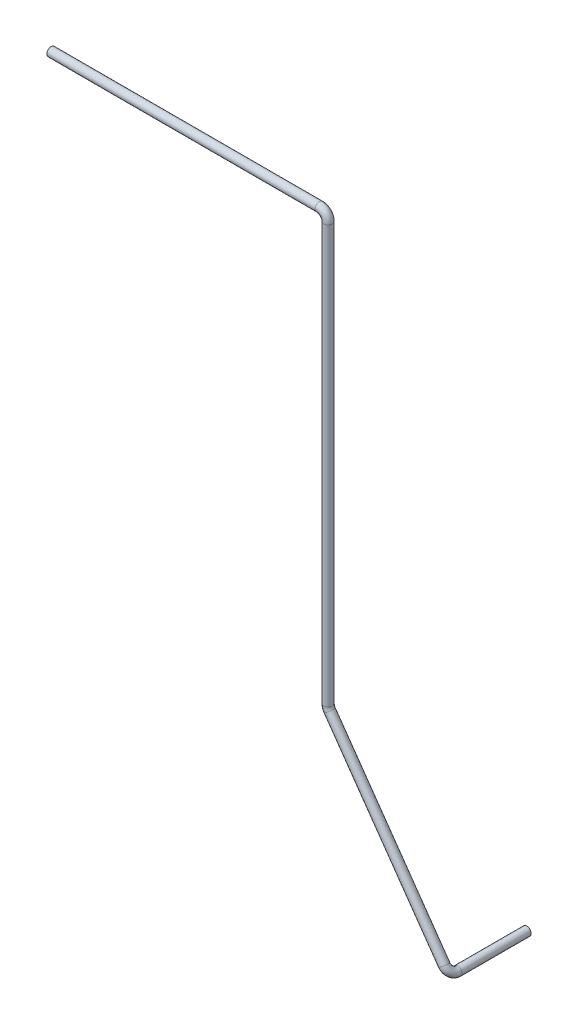
ISO-10303-21;
HEADER;
FILE_DESCRIPTION(('STEP AP214'),'2;1');
FILE_NAME('part.step','',(''),(''),'','','');
FILE_SCHEMA(('AUTOMOTIVE_DESIGN { 1 0 10303 214 1 1 1 1 }'));
ENDSEC;
DATA;
#1=APPLICATION_CONTEXT('core data for automotive mechanical design processes');
#2=APPLICATION_PROTOCOL_DEFINITION('international standard','automotive_design',2000,#1);
#3=PRODUCT_CONTEXT('',#1,'mechanical');
#4=PRODUCT('Part','Part','',(#3));
#5=PRODUCT_RELATED_PRODUCT_CATEGORY('part','',(#4));
#6=PRODUCT_DEFINITION_FORMATION('','',#4);
#7=PRODUCT_DEFINITION_CONTEXT('part definition',#1,'design');
#8=PRODUCT_DEFINITION('design','',#6,#7);
#9=PRODUCT_DEFINITION_SHAPE('','',#8);
#10=(LENGTH_UNIT() NAMED_UNIT(*) SI_UNIT(.MILLI.,.METRE.));
#11=(NAMED_UNIT(*) PLANE_ANGLE_UNIT() SI_UNIT($,.RADIAN.));
#12=(NAMED_UNIT(*) SI_UNIT($,.STERADIAN.) SOLID_ANGLE_UNIT());
#13=UNCERTAINTY_MEASURE_WITH_UNIT(LENGTH_MEASURE(1.E-05),#10,'distance_accuracy_value','');
#14=(GEOMETRIC_REPRESENTATION_CONTEXT(3) GLOBAL_UNCERTAINTY_ASSIGNED_CONTEXT((#13)) GLOBAL_UNIT_ASSIGNED_CONTEXT((#10,
#11,#12)) REPRESENTATION_CONTEXT('',''));
#15=CARTESIAN_POINT('',(0.,0.,0.));
#16=DIRECTION('',(0.,0.,1.));
#17=DIRECTION('',(1.,0.,0.));
#18=AXIS2_PLACEMENT_3D('',#15,#16,#17);
#19=CARTESIAN_POINT('',(-31243.2781005083,-14167.0136339347,40791.8371076484));
#20=DIRECTION('',(-1.,0.,0.));
#21=DIRECTION('',(0.,0.818643838091512,0.574301546537007));
#22=AXIS2_PLACEMENT_3D('',#19,#20,#21);
#23=PLANE('',#22);
#24=CARTESIAN_POINT('',(-31243.2781005083,-14167.0136339347,40791.8371076484));
#25=DIRECTION('',(-1.,0.,0.));
#26=DIRECTION('',(0.,0.,1.));
#27=AXIS2_PLACEMENT_3D('',#24,#25,#26);
#28=CIRCLE('',#27,14.0000000000006);
#29=CARTESIAN_POINT('',(-31243.2781005083,-14167.0136339347,40805.8371076484));
#30=VERTEX_POINT('',#29);
#31=EDGE_CURVE('E82',#30,#30,#28,.T.);
#32=ORIENTED_EDGE('',*,*,#31,.F.);
#33=EDGE_LOOP('',(#32));
#34=FACE_BOUND('',#33,.T.);
#35=CARTESIAN_POINT('',(-31243.2781005083,-14167.0136339347,40791.8371076484));
#36=DIRECTION('',(-1.,0.,0.));
#37=DIRECTION('',(0.,0.818643838091512,0.574301546537007));
#38=AXIS2_PLACEMENT_3D('',#35,#36,#37);
#39=CIRCLE('',#38,15.0000000000006);
#40=CARTESIAN_POINT('',(-31243.2781005083,-14154.7339763633,40800.4516308465));
#41=VERTEX_POINT('',#40);
#42=EDGE_CURVE('E75',#41,#41,#39,.T.);
#43=ORIENTED_EDGE('',*,*,#42,.T.);
#44=EDGE_LOOP('',(#43));
#45=FACE_BOUND('',#44,.T.);
#46=ADVANCED_FACE('F47',(#34,#45),#23,.T.);
#47=CARTESIAN_POINT('',(-29859.7978557255,-16257.8595632953,40521.7031960563));
#48=DIRECTION('',(0.,0.,1.));
#49=DIRECTION('',(1.,0.,0.));
#50=AXIS2_PLACEMENT_3D('',#47,#48,#49);
#51=PLANE('',#50);
#52=CARTESIAN_POINT('',(-29859.7978557255,-16257.8595632953,40521.7031960563));
#53=DIRECTION('',(0.,0.,1.));
#54=DIRECTION('',(1.,0.,0.));
#55=AXIS2_PLACEMENT_3D('',#52,#53,#54);
#56=CIRCLE('',#55,14.0000000000006);
#57=CARTESIAN_POINT('',(-29845.7978557255,-16257.8595632953,40521.7031960563));
#58=VERTEX_POINT('',#57);
#59=EDGE_CURVE('E78',#58,#58,#56,.T.);
#60=ORIENTED_EDGE('',*,*,#59,.T.);
#61=EDGE_LOOP('',(#60));
#62=FACE_BOUND('',#61,.T.);
#63=CARTESIAN_POINT('',(-29859.7978557255,-16257.8595632953,40521.7031960563));
#64=DIRECTION('',(0.,0.,1.));
#65=DIRECTION('',(1.,0.,0.));
#66=AXIS2_PLACEMENT_3D('',#63,#64,#65);
#67=CIRCLE('',#66,15.0000000000006);
#68=CARTESIAN_POINT('',(-29844.7978557255,-16257.8595632953,40521.7031960563));
#69=VERTEX_POINT('',#68);
#70=EDGE_CURVE('E11',#69,#69,#67,.T.);
#71=ORIENTED_EDGE('',*,*,#70,.F.);
#72=EDGE_LOOP('',(#71));
#73=FACE_BOUND('',#72,.T.);
#74=ADVANCED_FACE('F114',(#62,#73),#51,.F.);
#75=CARTESIAN_POINT('',(-31243.2781005083,-14167.0136339347,40791.8371076484));
#76=DIRECTION('',(1.,0.,0.));
#77=DIRECTION('',(0.,0.,-1.));
#78=AXIS2_PLACEMENT_3D('',#75,#76,#77);
#79=CYLINDRICAL_SURFACE('',#78,15.0000000000006);
#80=CARTESIAN_POINT('',(-30310.4639661704,-14167.0136339347,40791.8371076484));
#81=DIRECTION('',(-1.,0.,0.));
#82=DIRECTION('',(0.,0.818643838091512,0.574301546537007));
#83=AXIS2_PLACEMENT_3D('',#80,#81,#82);
#84=CIRCLE('',#83,15.0000000000006);
#85=CARTESIAN_POINT('',(-30310.4639661704,-14152.0136339347,40791.8371076484));
#86=VERTEX_POINT('',#85);
#87=EDGE_CURVE('E72',#86,#86,#84,.T.);
#88=ORIENTED_EDGE('',*,*,#87,.T.);
#89=EDGE_LOOP('',(#88));
#90=FACE_BOUND('',#89,.T.);
#91=ORIENTED_EDGE('',*,*,#42,.F.);
#92=EDGE_LOOP('',(#91));
#93=FACE_BOUND('',#92,.T.);
#94=ADVANCED_FACE('F118',(#90,#93),#79,.T.);
#95=CARTESIAN_POINT('',(-30310.4639661704,-14197.0136339347,40791.8371076484));
#96=DIRECTION('',(0.,0.,-1.));
#97=DIRECTION('',(-1.,0.,0.));
#98=AXIS2_PLACEMENT_3D('',#95,#96,#97);
#99=TOROIDAL_SURFACE('',#98,30.0000000000011,15.0000000000006);
#100=CARTESIAN_POINT('',(-30280.4639661704,-14197.0136339347,40791.8371076484));
#101=DIRECTION('',(0.,1.,0.));
#102=DIRECTION('',(0.818643838091512,0.,0.574301546537007));
#103=AXIS2_PLACEMENT_3D('',#100,#101,#102);
#104=CIRCLE('',#103,15.0000000000006);
#105=CARTESIAN_POINT('',(-30265.4639661704,-14197.0136339347,40791.8371076484));
#106=VERTEX_POINT('',#105);
#107=EDGE_CURVE('E69',#106,#106,#104,.T.);
#108=CARTESIAN_POINT('',(-30310.4639661704,-14197.0136339347,40791.8371076484));
#109=DIRECTION('',(0.,0.,-1.));
#110=DIRECTION('',(-1.,0.,0.));
#111=AXIS2_PLACEMENT_3D('',#108,#109,#110);
#112=CIRCLE('',#111,45.0000000000017);
#113=EDGE_CURVE('',#86,#106,#112,.T.);
#114=ORIENTED_EDGE('',*,*,#87,.F.);
#115=ORIENTED_EDGE('',*,*,#107,.T.);
#116=ORIENTED_EDGE('',*,*,#113,.T.);
#117=ORIENTED_EDGE('',*,*,#113,.F.);
#118=EDGE_LOOP('',(#114,#116,#115,#117));
#119=FACE_BOUND('',#118,.T.);
#120=ADVANCED_FACE('F120',(#119),#99,.T.);
#121=CARTESIAN_POINT('',(-30280.4639661704,-14197.0136339347,40791.8371076484));
#122=DIRECTION('',(0.,-1.,0.));
#123=DIRECTION('',(0.,0.,-1.));
#124=AXIS2_PLACEMENT_3D('',#121,#122,#123);
#125=CYLINDRICAL_SURFACE('',#124,15.0000000000006);
#126=CARTESIAN_POINT('',(-30280.4639661704,-15648.7433138681,40791.8371076484));
#127=DIRECTION('',(0.,1.,0.));
#128=DIRECTION('',(0.818643838091512,0.,0.574301546537007));
#129=AXIS2_PLACEMENT_3D('',#126,#127,#128);
#130=CIRCLE('',#129,15.0000000000006);
#131=CARTESIAN_POINT('',(-30295.4639661704,-15648.7433138681,40791.8371076484));
#132=VERTEX_POINT('',#131);
#133=EDGE_CURVE('E66',#132,#132,#130,.T.);
#134=ORIENTED_EDGE('',*,*,#133,.T.);
#135=EDGE_LOOP('',(#134));
#136=FACE_BOUND('',#135,.T.);
#137=ORIENTED_EDGE('',*,*,#107,.F.);
#138=EDGE_LOOP('',(#137));
#139=FACE_BOUND('',#138,.T.);
#140=ADVANCED_FACE('F127',(#136,#139),#125,.T.);
#141=CARTESIAN_POINT('',(-30250.4639661704,-15648.7433138681,40791.8371076484));
#142=DIRECTION('',(0.,0.,1.));
#143=DIRECTION('',(1.,0.,0.));
#144=AXIS2_PLACEMENT_3D('',#141,#142,#143);
#145=TOROIDAL_SURFACE('',#144,30.0000000000011,15.0000000000006);
#146=CARTESIAN_POINT('',(-30275.0232813132,-15665.9723602642,40791.8371076484));
#147=DIRECTION('',(-0.574301546536833,0.818643838091634,0.));
#148=DIRECTION('',(0.670177733645302,0.470148422278804,0.574301546537007));
#149=AXIS2_PLACEMENT_3D('',#146,#147,#148);
#150=CIRCLE('',#149,15.0000000000006);
#151=CARTESIAN_POINT('',(-30287.3029388845,-15674.5868834622,40791.8371076484));
#152=VERTEX_POINT('',#151);
#153=EDGE_CURVE('E61',#152,#152,#150,.T.);
#154=CARTESIAN_POINT('',(-30250.4639661704,-15648.7433138681,40791.8371076484));
#155=DIRECTION('',(0.,0.,1.));
#156=DIRECTION('',(1.,0.,0.));
#157=AXIS2_PLACEMENT_3D('',#154,#155,#156);
#158=CIRCLE('',#157,45.0000000000017);
#159=EDGE_CURVE('',#132,#152,#158,.T.);
#160=ORIENTED_EDGE('',*,*,#133,.F.);
#161=ORIENTED_EDGE('',*,*,#153,.T.);
#162=ORIENTED_EDGE('',*,*,#159,.T.);
#163=ORIENTED_EDGE('',*,*,#159,.F.);
#164=EDGE_LOOP('',(#160,#162,#161,#163));
#165=FACE_BOUND('',#164,.T.);
#166=ADVANCED_FACE('F144',(#165),#145,.T.);
#167=CARTESIAN_POINT('',(-30275.0232813132,-15665.9723602642,40791.8371076484));
#168=DIRECTION('',(0.574301546536964,-0.818643838091542,0.));
#169=DIRECTION('',(0.818643838091542,0.574301546536964,0.));
#170=AXIS2_PLACEMENT_3D('',#167,#168,#169);
#171=CYLINDRICAL_SURFACE('',#170,15.0000000000006);
#172=CARTESIAN_POINT('',(-29877.0269021217,-16233.3002481526,40791.8371076484));
#173=DIRECTION('',(-0.574301546536964,0.818643838091542,0.));
#174=DIRECTION('',(0.670177733645226,0.470148422278911,0.574301546537007));
#175=AXIS2_PLACEMENT_3D('',#172,#173,#174);
#176=CIRCLE('',#175,15.0000000000006);
#177=CARTESIAN_POINT('',(-29877.0269021217,-16233.3002481526,40806.8371076484));
#178=VERTEX_POINT('',#177);
#179=EDGE_CURVE('E57',#178,#178,#176,.T.);
#180=ORIENTED_EDGE('',*,*,#179,.T.);
#181=EDGE_LOOP('',(#180));
#182=FACE_BOUND('',#181,.T.);
#183=ORIENTED_EDGE('',*,*,#153,.F.);
#184=EDGE_LOOP('',(#183));
#185=FACE_BOUND('',#184,.T.);
#186=ADVANCED_FACE('F138',(#182,#185),#171,.T.);
#187=CARTESIAN_POINT('',(-29877.0269021216,-16233.3002481526,40761.8371076484));
#188=DIRECTION('',(0.818643838091512,0.574301546537008,0.));
#189=DIRECTION('',(-0.574301546537008,0.818643838091512,0.));
#190=AXIS2_PLACEMENT_3D('',#187,#188,#189);
#191=TOROIDAL_SURFACE('',#190,30.0000000000082,15.0000000000006);
#192=CARTESIAN_POINT('',(-29859.79785572,-16257.8595633032,40761.8371076493));
#193=DIRECTION('',(0.,0.,1.));
#194=DIRECTION('',(1.,0.,0.));
#195=AXIS2_PLACEMENT_3D('',#192,#193,#194);
#196=CIRCLE('',#195,15.0000000000006);
#197=CARTESIAN_POINT('',(-29851.1833325275,-16270.1392208667,40761.8371076498));
#198=VERTEX_POINT('',#197);
#199=EDGE_CURVE('E53',#198,#198,#196,.T.);
#200=CARTESIAN_POINT('',(-29877.0269021216,-16233.3002481526,40761.8371076484));
#201=DIRECTION('',(0.818643838091512,0.574301546537008,0.));
#202=DIRECTION('',(-0.574301546537008,0.818643838091512,0.));
#203=AXIS2_PLACEMENT_3D('',#200,#201,#202);
#204=CIRCLE('',#203,45.0000000000088);
#205=EDGE_CURVE('',#178,#198,#204,.T.);
#206=ORIENTED_EDGE('',*,*,#179,.F.);
#207=ORIENTED_EDGE('',*,*,#199,.T.);
#208=ORIENTED_EDGE('',*,*,#205,.T.);
#209=ORIENTED_EDGE('',*,*,#205,.F.);
#210=EDGE_LOOP('',(#206,#208,#207,#209));
#211=FACE_BOUND('',#210,.T.);
#212=ADVANCED_FACE('F133',(#211),#191,.T.);
#213=CARTESIAN_POINT('',(-29859.7978557255,-16257.8595632953,40761.8371076484));
#214=DIRECTION('',(0.,0.,-1.));
#215=DIRECTION('',(-1.,0.,0.));
#216=AXIS2_PLACEMENT_3D('',#213,#214,#215);
#217=CYLINDRICAL_SURFACE('',#216,15.0000000000006);
#218=ORIENTED_EDGE('',*,*,#70,.T.);
#219=EDGE_LOOP('',(#218));
#220=FACE_BOUND('',#219,.T.);
#221=ORIENTED_EDGE('',*,*,#199,.F.);
#222=EDGE_LOOP('',(#221));
#223=FACE_BOUND('',#222,.T.);
#224=ADVANCED_FACE('F108',(#220,#223),#217,.T.);
#225=CARTESIAN_POINT('',(-31243.2781005083,-14167.0136339347,40791.8371076484));
#226=DIRECTION('',(1.,0.,0.));
#227=DIRECTION('',(0.,0.,-1.));
#228=AXIS2_PLACEMENT_3D('',#225,#226,#227);
#229=CYLINDRICAL_SURFACE('',#228,14.0000000000006);
#230=CARTESIAN_POINT('',(-30310.4639661704,-14167.0136339347,40791.8371076484));
#231=DIRECTION('',(1.,0.,0.));
#232=DIRECTION('',(0.,0.,-1.));
#233=AXIS2_PLACEMENT_3D('',#230,#231,#232);
#234=CIRCLE('',#233,14.0000000000006);
#235=CARTESIAN_POINT('',(-30310.4639661704,-14153.0136339347,40791.8371076484));
#236=VERTEX_POINT('',#235);
#237=EDGE_CURVE('E85',#236,#236,#234,.F.);
#238=ORIENTED_EDGE('',*,*,#237,.F.);
#239=EDGE_LOOP('',(#238));
#240=FACE_BOUND('',#239,.T.);
#241=ORIENTED_EDGE('',*,*,#31,.T.);
#242=EDGE_LOOP('',(#241));
#243=FACE_BOUND('',#242,.T.);
#244=ADVANCED_FACE('F105',(#240,#243),#229,.F.);
#245=CARTESIAN_POINT('',(-30310.4639661704,-14197.0136339347,40791.8371076484));
#246=DIRECTION('',(0.,0.,-1.));
#247=DIRECTION('',(-1.,0.,0.));
#248=AXIS2_PLACEMENT_3D('',#245,#246,#247);
#249=TOROIDAL_SURFACE('',#248,30.0000000000011,14.0000000000006);
#250=CARTESIAN_POINT('',(-30280.4639661704,-14197.0136339347,40791.8371076484));
#251=DIRECTION('',(0.,1.,0.));
#252=DIRECTION('',(-1.,0.,0.));
#253=AXIS2_PLACEMENT_3D('',#250,#251,#252);
#254=CIRCLE('',#253,14.0000000000006);
#255=CARTESIAN_POINT('',(-30266.4639661704,-14197.0136339347,40791.8371076484));
#256=VERTEX_POINT('',#255);
#257=EDGE_CURVE('E97',#256,#256,#254,.T.);
#258=CARTESIAN_POINT('',(-30310.4639661704,-14197.0136339347,40791.8371076484));
#259=DIRECTION('',(0.,0.,-1.));
#260=DIRECTION('',(-1.,0.,0.));
#261=AXIS2_PLACEMENT_3D('',#258,#259,#260);
#262=CIRCLE('',#261,44.0000000000017);
#263=EDGE_CURVE('',#236,#256,#262,.T.);
#264=ORIENTED_EDGE('',*,*,#237,.T.);
#265=ORIENTED_EDGE('',*,*,#257,.F.);
#266=ORIENTED_EDGE('',*,*,#263,.T.);
#267=ORIENTED_EDGE('',*,*,#263,.F.);
#268=EDGE_LOOP('',(#264,#266,#265,#267));
#269=FACE_BOUND('',#268,.T.);
#270=ADVANCED_FACE('F103',(#269),#249,.F.);
#271=CARTESIAN_POINT('',(-30280.4639661704,-14197.0136339347,40791.8371076484));
#272=DIRECTION('',(0.,-1.,0.));
#273=DIRECTION('',(0.,0.,-1.));
#274=AXIS2_PLACEMENT_3D('',#271,#272,#273);
#275=CYLINDRICAL_SURFACE('',#274,14.0000000000006);
#276=CARTESIAN_POINT('',(-30280.4639661704,-15648.7433138681,40791.8371076484));
#277=DIRECTION('',(0.,-1.,0.));
#278=DIRECTION('',(0.,0.,-1.));
#279=AXIS2_PLACEMENT_3D('',#276,#277,#278);
#280=CIRCLE('',#279,14.0000000000006);
#281=CARTESIAN_POINT('',(-30294.4639661704,-15648.7433138681,40791.8371076484));
#282=VERTEX_POINT('',#281);
#283=EDGE_CURVE('E94',#282,#282,#280,.F.);
#284=ORIENTED_EDGE('',*,*,#283,.F.);
#285=EDGE_LOOP('',(#284));
#286=FACE_BOUND('',#285,.T.);
#287=ORIENTED_EDGE('',*,*,#257,.T.);
#288=EDGE_LOOP('',(#287));
#289=FACE_BOUND('',#288,.T.);
#290=ADVANCED_FACE('F195',(#286,#289),#275,.F.);
#291=CARTESIAN_POINT('',(-30250.4639661704,-15648.7433138681,40791.8371076484));
#292=DIRECTION('',(0.,0.,1.));
#293=DIRECTION('',(1.,0.,0.));
#294=AXIS2_PLACEMENT_3D('',#291,#292,#293);
#295=TOROIDAL_SURFACE('',#294,30.0000000000011,14.0000000000006);
#296=CARTESIAN_POINT('',(-30275.0232813132,-15665.9723602642,40791.8371076484));
#297=DIRECTION('',(-0.574301546536802,0.818643838091656,0.));
#298=DIRECTION('',(-0.818643838091656,-0.574301546536802,0.));
#299=AXIS2_PLACEMENT_3D('',#296,#297,#298);
#300=CIRCLE('',#299,14.0000000000006);
#301=CARTESIAN_POINT('',(-30286.4842950464,-15674.0125819157,40791.8371076484));
#302=VERTEX_POINT('',#301);
#303=EDGE_CURVE('E91',#302,#302,#300,.T.);
#304=CARTESIAN_POINT('',(-30250.4639661704,-15648.7433138681,40791.8371076484));
#305=DIRECTION('',(0.,0.,1.));
#306=DIRECTION('',(1.,0.,0.));
#307=AXIS2_PLACEMENT_3D('',#304,#305,#306);
#308=CIRCLE('',#307,44.0000000000017);
#309=EDGE_CURVE('',#282,#302,#308,.T.);
#310=ORIENTED_EDGE('',*,*,#283,.T.);
#311=ORIENTED_EDGE('',*,*,#303,.F.);
#312=ORIENTED_EDGE('',*,*,#309,.T.);
#313=ORIENTED_EDGE('',*,*,#309,.F.);
#314=EDGE_LOOP('',(#310,#312,#311,#313));
#315=FACE_BOUND('',#314,.T.);
#316=ADVANCED_FACE('F206',(#315),#295,.F.);
#317=CARTESIAN_POINT('',(-30275.0232813132,-15665.9723602642,40791.8371076484));
#318=DIRECTION('',(0.574301546536964,-0.818643838091542,0.));
#319=DIRECTION('',(0.818643838091542,0.574301546536964,0.));
#320=AXIS2_PLACEMENT_3D('',#317,#318,#319);
#321=CYLINDRICAL_SURFACE('',#320,14.0000000000006);
#322=CARTESIAN_POINT('',(-29877.0269021217,-16233.3002481526,40791.8371076484));
#323=DIRECTION('',(0.574301546536964,-0.818643838091542,0.));
#324=DIRECTION('',(0.818643838091542,0.574301546536964,0.));
#325=AXIS2_PLACEMENT_3D('',#322,#323,#324);
#326=CIRCLE('',#325,14.0000000000006);
#327=CARTESIAN_POINT('',(-29877.0269021217,-16233.3002481526,40805.8371076484));
#328=VERTEX_POINT('',#327);
#329=EDGE_CURVE('E88',#328,#328,#326,.F.);
#330=ORIENTED_EDGE('',*,*,#329,.F.);
#331=EDGE_LOOP('',(#330));
#332=FACE_BOUND('',#331,.T.);
#333=ORIENTED_EDGE('',*,*,#303,.T.);
#334=EDGE_LOOP('',(#333));
#335=FACE_BOUND('',#334,.T.);
#336=ADVANCED_FACE('F217',(#332,#335),#321,.F.);
#337=CARTESIAN_POINT('',(-29877.0269021216,-16233.3002481526,40761.8371076484));
#338=DIRECTION('',(0.818643838091512,0.574301546537008,0.));
#339=DIRECTION('',(-0.574301546537008,0.818643838091512,0.));
#340=AXIS2_PLACEMENT_3D('',#337,#338,#339);
#341=TOROIDAL_SURFACE('',#340,30.0000000000082,14.0000000000006);
#342=CARTESIAN_POINT('',(-29859.7978557255,-16257.8595632953,40761.8371076493));
#343=DIRECTION('',(0.,0.,-1.));
#344=DIRECTION('',(-1.,0.,0.));
#345=AXIS2_PLACEMENT_3D('',#342,#343,#344);
#346=CIRCLE('',#345,14.0000000000006);
#347=CARTESIAN_POINT('',(-29851.757634074,-16269.3205770286,40761.8371076498));
#348=VERTEX_POINT('',#347);
#349=EDGE_CURVE('E81',#348,#348,#346,.F.);
#350=CARTESIAN_POINT('',(-29877.0269021216,-16233.3002481526,40761.8371076484));
#351=DIRECTION('',(0.818643838091512,0.574301546537008,0.));
#352=DIRECTION('',(-0.574301546537008,0.818643838091512,0.));
#353=AXIS2_PLACEMENT_3D('',#350,#351,#352);
#354=CIRCLE('',#353,44.0000000000088);
#355=EDGE_CURVE('',#328,#348,#354,.T.);
#356=ORIENTED_EDGE('',*,*,#329,.T.);
#357=ORIENTED_EDGE('',*,*,#349,.F.);
#358=ORIENTED_EDGE('',*,*,#355,.T.);
#359=ORIENTED_EDGE('',*,*,#355,.F.);
#360=EDGE_LOOP('',(#356,#358,#357,#359));
#361=FACE_BOUND('',#360,.T.);
#362=ADVANCED_FACE('F228',(#361),#341,.F.);
#363=CARTESIAN_POINT('',(-29859.7978557255,-16257.8595632953,40761.8371076484));
#364=DIRECTION('',(0.,0.,-1.));
#365=DIRECTION('',(-1.,0.,0.));
#366=AXIS2_PLACEMENT_3D('',#363,#364,#365);
#367=CYLINDRICAL_SURFACE('',#366,14.0000000000006);
#368=ORIENTED_EDGE('',*,*,#59,.F.);
#369=EDGE_LOOP('',(#368));
#370=FACE_BOUND('',#369,.T.);
#371=ORIENTED_EDGE('',*,*,#349,.T.);
#372=EDGE_LOOP('',(#371));
#373=FACE_BOUND('',#372,.T.);
#374=ADVANCED_FACE('F115',(#370,#373),#367,.F.);
#375=CLOSED_SHELL('',(#46,#74,#94,#120,#140,#166,#186,#212,#224,#244,#270,#290,#316,#336,#362,#374));
#376=MANIFOLD_SOLID_BREP('B2',#375);
#377=ADVANCED_BREP_SHAPE_REPRESENTATION('',(#18,#376),#14);
#378=SHAPE_DEFINITION_REPRESENTATION(#9,#377);
ENDSEC;
END-ISO-10303-21;
